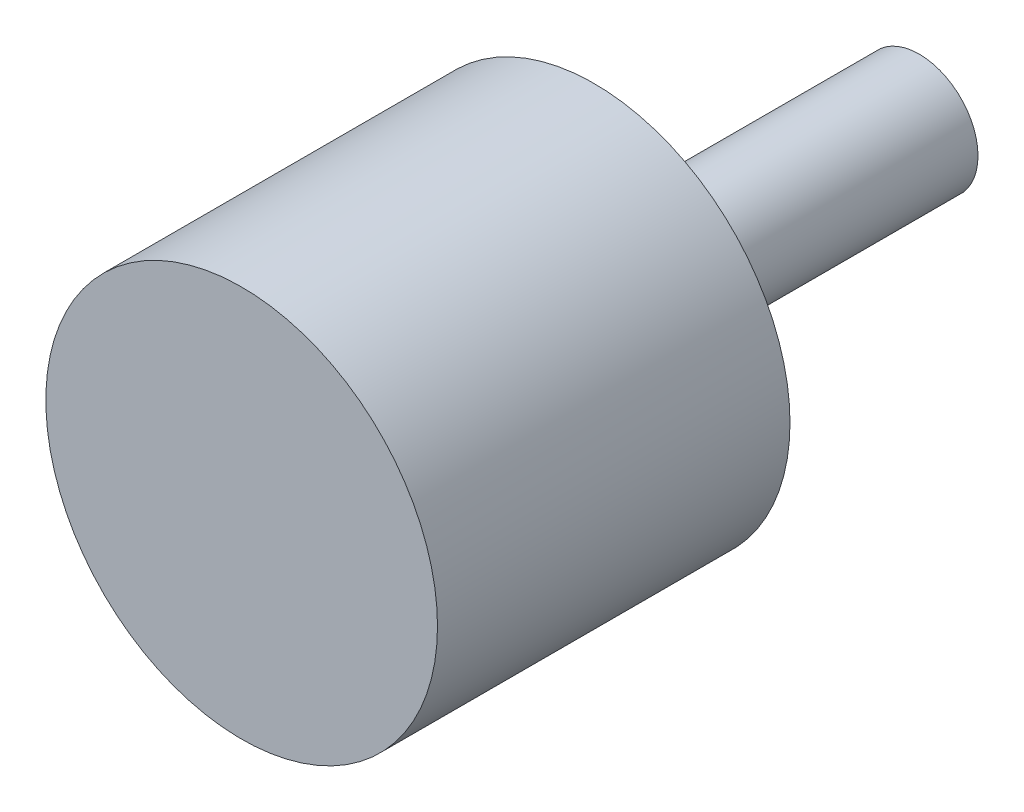
ISO-10303-21;
HEADER;
FILE_DESCRIPTION(('STEP AP214'),'2;1');
FILE_NAME('part.step','',(''),(''),'','','');
FILE_SCHEMA(('AUTOMOTIVE_DESIGN { 1 0 10303 214 1 1 1 1 }'));
ENDSEC;
DATA;
#1=APPLICATION_CONTEXT('core data for automotive mechanical design processes');
#2=APPLICATION_PROTOCOL_DEFINITION('international standard','automotive_design',2000,#1);
#3=PRODUCT_CONTEXT('',#1,'mechanical');
#4=PRODUCT('Part','Part','',(#3));
#5=PRODUCT_RELATED_PRODUCT_CATEGORY('part','',(#4));
#6=PRODUCT_DEFINITION_FORMATION('','',#4);
#7=PRODUCT_DEFINITION_CONTEXT('part definition',#1,'design');
#8=PRODUCT_DEFINITION('design','',#6,#7);
#9=PRODUCT_DEFINITION_SHAPE('','',#8);
#10=(LENGTH_UNIT() NAMED_UNIT(*) SI_UNIT(.MILLI.,.METRE.));
#11=(NAMED_UNIT(*) PLANE_ANGLE_UNIT() SI_UNIT($,.RADIAN.));
#12=(NAMED_UNIT(*) SI_UNIT($,.STERADIAN.) SOLID_ANGLE_UNIT());
#13=UNCERTAINTY_MEASURE_WITH_UNIT(LENGTH_MEASURE(1.E-05),#10,'distance_accuracy_value','');
#14=(GEOMETRIC_REPRESENTATION_CONTEXT(3) GLOBAL_UNCERTAINTY_ASSIGNED_CONTEXT((#13)) GLOBAL_UNIT_ASSIGNED_CONTEXT((#10,
#11,#12)) REPRESENTATION_CONTEXT('',''));
#15=CARTESIAN_POINT('',(0.,0.,0.));
#16=DIRECTION('',(0.,0.,1.));
#17=DIRECTION('',(1.,0.,0.));
#18=AXIS2_PLACEMENT_3D('',#15,#16,#17);
#19=CARTESIAN_POINT('',(0.,0.,9.));
#20=DIRECTION('',(0.,0.,-1.));
#21=DIRECTION('',(-1.,0.,0.));
#22=AXIS2_PLACEMENT_3D('',#19,#20,#21);
#23=CYLINDRICAL_SURFACE('',#22,5.);
#24=CARTESIAN_POINT('',(0.,0.,9.));
#25=DIRECTION('',(0.,0.,1.));
#26=DIRECTION('',(1.,0.,0.));
#27=AXIS2_PLACEMENT_3D('',#24,#25,#26);
#28=CIRCLE('',#27,5.);
#29=CARTESIAN_POINT('',(5.,0.,9.));
#30=VERTEX_POINT('',#29);
#31=EDGE_CURVE('E39',#30,#30,#28,.T.);
#32=ORIENTED_EDGE('',*,*,#31,.F.);
#33=EDGE_LOOP('',(#32));
#34=FACE_BOUND('',#33,.T.);
#35=CARTESIAN_POINT('',(0.,0.,0.));
#36=DIRECTION('',(0.,0.,1.));
#37=DIRECTION('',(1.,0.,0.));
#38=AXIS2_PLACEMENT_3D('',#35,#36,#37);
#39=CIRCLE('',#38,5.);
#40=CARTESIAN_POINT('',(5.,0.,0.));
#41=VERTEX_POINT('',#40);
#42=EDGE_CURVE('E43',#41,#41,#39,.T.);
#43=ORIENTED_EDGE('',*,*,#42,.T.);
#44=EDGE_LOOP('',(#43));
#45=FACE_BOUND('',#44,.T.);
#46=ADVANCED_FACE('F33',(#34,#45),#23,.T.);
#47=CARTESIAN_POINT('',(0.,0.,9.));
#48=DIRECTION('',(0.,0.,1.));
#49=DIRECTION('',(1.,0.,0.));
#50=AXIS2_PLACEMENT_3D('',#47,#48,#49);
#51=PLANE('',#50);
#52=ORIENTED_EDGE('',*,*,#31,.T.);
#53=EDGE_LOOP('',(#52));
#54=FACE_BOUND('',#53,.T.);
#55=ADVANCED_FACE('F64',(#54),#51,.T.);
#56=CARTESIAN_POINT('',(0.,0.,0.));
#57=DIRECTION('',(0.,0.,1.));
#58=DIRECTION('',(1.,0.,0.));
#59=AXIS2_PLACEMENT_3D('',#56,#57,#58);
#60=PLANE('',#59);
#61=CARTESIAN_POINT('',(0.,0.,0.));
#62=DIRECTION('',(0.,0.,1.));
#63=DIRECTION('',(1.,0.,0.));
#64=AXIS2_PLACEMENT_3D('',#61,#62,#63);
#65=CIRCLE('',#64,1.5);
#66=CARTESIAN_POINT('',(1.5,0.,0.));
#67=VERTEX_POINT('',#66);
#68=EDGE_CURVE('E10',#67,#67,#65,.F.);
#69=ORIENTED_EDGE('',*,*,#68,.F.);
#70=EDGE_LOOP('',(#69));
#71=FACE_BOUND('',#70,.T.);
#72=ORIENTED_EDGE('',*,*,#42,.F.);
#73=EDGE_LOOP('',(#72));
#74=FACE_BOUND('',#73,.T.);
#75=ADVANCED_FACE('F57',(#71,#74),#60,.F.);
#76=CARTESIAN_POINT('',(0.,0.,-8.3));
#77=DIRECTION('',(0.,0.,1.));
#78=DIRECTION('',(1.,0.,0.));
#79=AXIS2_PLACEMENT_3D('',#76,#77,#78);
#80=CYLINDRICAL_SURFACE('',#79,1.5);
#81=CARTESIAN_POINT('',(0.,0.,-8.3));
#82=DIRECTION('',(0.,0.,-1.));
#83=DIRECTION('',(-1.,0.,0.));
#84=AXIS2_PLACEMENT_3D('',#81,#82,#83);
#85=CIRCLE('',#84,1.5);
#86=CARTESIAN_POINT('',(-1.5,0.,-8.3));
#87=VERTEX_POINT('',#86);
#88=EDGE_CURVE('E48',#87,#87,#85,.T.);
#89=ORIENTED_EDGE('',*,*,#88,.F.);
#90=EDGE_LOOP('',(#89));
#91=FACE_BOUND('',#90,.T.);
#92=ORIENTED_EDGE('',*,*,#68,.T.);
#93=EDGE_LOOP('',(#92));
#94=FACE_BOUND('',#93,.T.);
#95=ADVANCED_FACE('F55',(#91,#94),#80,.T.);
#96=CARTESIAN_POINT('',(0.,0.,-8.3));
#97=DIRECTION('',(0.,0.,-1.));
#98=DIRECTION('',(-1.,0.,0.));
#99=AXIS2_PLACEMENT_3D('',#96,#97,#98);
#100=PLANE('',#99);
#101=ORIENTED_EDGE('',*,*,#88,.T.);
#102=EDGE_LOOP('',(#101));
#103=FACE_BOUND('',#102,.T.);
#104=ADVANCED_FACE('F53',(#103),#100,.T.);
#105=CLOSED_SHELL('',(#46,#55,#75,#95,#104));
#106=MANIFOLD_SOLID_BREP('B2',#105);
#107=ADVANCED_BREP_SHAPE_REPRESENTATION('',(#18,#106),#14);
#108=SHAPE_DEFINITION_REPRESENTATION(#9,#107);
ENDSEC;
END-ISO-10303-21;
